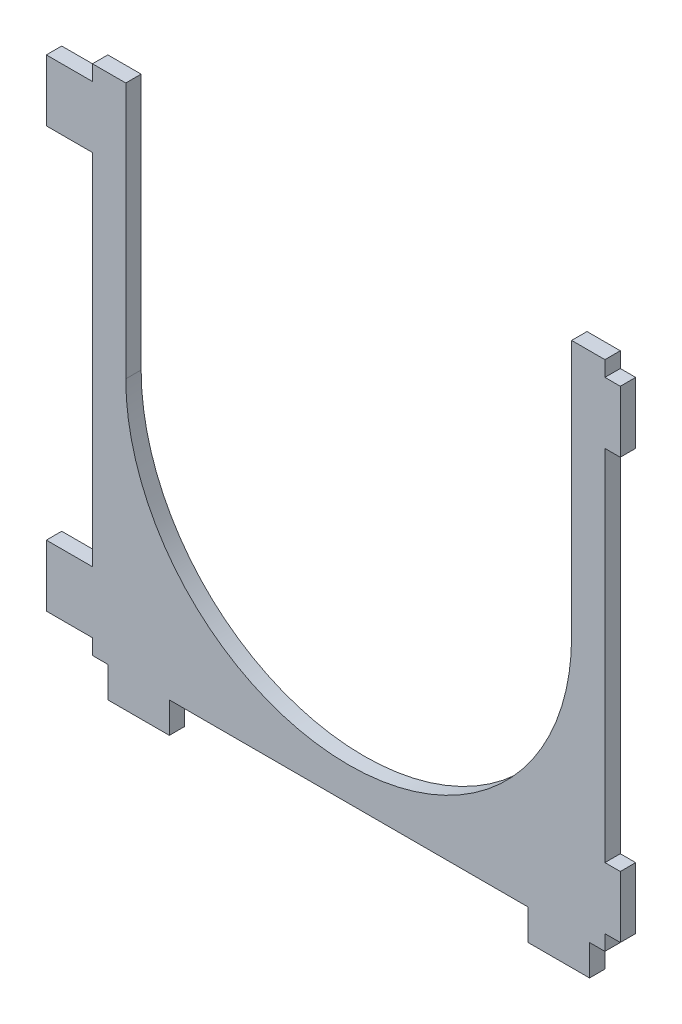
ISO-10303-21;
HEADER;
FILE_DESCRIPTION(('STEP AP214'),'2;1');
FILE_NAME('part.step','',(''),(''),'','','');
FILE_SCHEMA(('AUTOMOTIVE_DESIGN { 1 0 10303 214 1 1 1 1 }'));
ENDSEC;
DATA;
#1=APPLICATION_CONTEXT('core data for automotive mechanical design processes');
#2=APPLICATION_PROTOCOL_DEFINITION('international standard','automotive_design',2000,#1);
#3=PRODUCT_CONTEXT('',#1,'mechanical');
#4=PRODUCT('Part','Part','',(#3));
#5=PRODUCT_RELATED_PRODUCT_CATEGORY('part','',(#4));
#6=PRODUCT_DEFINITION_FORMATION('','',#4);
#7=PRODUCT_DEFINITION_CONTEXT('part definition',#1,'design');
#8=PRODUCT_DEFINITION('design','',#6,#7);
#9=PRODUCT_DEFINITION_SHAPE('','',#8);
#10=(LENGTH_UNIT() NAMED_UNIT(*) SI_UNIT(.MILLI.,.METRE.));
#11=(NAMED_UNIT(*) PLANE_ANGLE_UNIT() SI_UNIT($,.RADIAN.));
#12=(NAMED_UNIT(*) SI_UNIT($,.STERADIAN.) SOLID_ANGLE_UNIT());
#13=UNCERTAINTY_MEASURE_WITH_UNIT(LENGTH_MEASURE(1.E-05),#10,'distance_accuracy_value','');
#14=(GEOMETRIC_REPRESENTATION_CONTEXT(3) GLOBAL_UNCERTAINTY_ASSIGNED_CONTEXT((#13)) GLOBAL_UNIT_ASSIGNED_CONTEXT((#10,
#11,#12)) REPRESENTATION_CONTEXT('',''));
#15=CARTESIAN_POINT('',(0.,0.,0.));
#16=DIRECTION('',(0.,0.,1.));
#17=DIRECTION('',(1.,0.,0.));
#18=AXIS2_PLACEMENT_3D('',#15,#16,#17);
#19=CARTESIAN_POINT('',(-50.,50.,3.));
#20=DIRECTION('',(0.,-1.,0.));
#21=DIRECTION('',(0.,0.,-1.));
#22=AXIS2_PLACEMENT_3D('',#19,#20,#21);
#23=PLANE('',#22);
#24=DIRECTION('',(-1.,0.,0.));
#25=VECTOR('',#24,1.);
#26=CARTESIAN_POINT('',(-50.,50.,3.));
#27=LINE('',#26,#25);
#28=CARTESIAN_POINT('',(-43.5,50.,3.));
#29=VERTEX_POINT('',#28);
#30=CARTESIAN_POINT('',(-50.,50.,3.));
#31=VERTEX_POINT('',#30);
#32=EDGE_CURVE('E272',#29,#31,#27,.T.);
#33=ORIENTED_EDGE('',*,*,#32,.F.);
#34=DIRECTION('',(0.,0.,1.));
#35=VECTOR('',#34,1.);
#36=CARTESIAN_POINT('',(-43.5,50.,-7.));
#37=LINE('',#36,#35);
#38=CARTESIAN_POINT('',(-43.5,50.,0.));
#39=VERTEX_POINT('',#38);
#40=EDGE_CURVE('E326',#39,#29,#37,.T.);
#41=ORIENTED_EDGE('',*,*,#40,.F.);
#42=DIRECTION('',(-1.,0.,0.));
#43=VECTOR('',#42,1.);
#44=CARTESIAN_POINT('',(-50.,50.,0.));
#45=LINE('',#44,#43);
#46=CARTESIAN_POINT('',(-50.,50.,0.));
#47=VERTEX_POINT('',#46);
#48=EDGE_CURVE('E288',#39,#47,#45,.T.);
#49=ORIENTED_EDGE('',*,*,#48,.T.);
#50=DIRECTION('',(0.,0.,-1.));
#51=VECTOR('',#50,1.);
#52=CARTESIAN_POINT('',(-50.,50.,3.));
#53=LINE('',#52,#51);
#54=EDGE_CURVE('E307',#31,#47,#53,.T.);
#55=ORIENTED_EDGE('',*,*,#54,.F.);
#56=EDGE_LOOP('',(#33,#41,#49,#55));
#57=FACE_BOUND('',#56,.T.);
#58=ADVANCED_FACE('F33',(#57),#23,.F.);
#59=CARTESIAN_POINT('',(-50.,-50.,3.));
#60=DIRECTION('',(1.,0.,0.));
#61=DIRECTION('',(0.,0.,-1.));
#62=AXIS2_PLACEMENT_3D('',#59,#60,#61);
#63=PLANE('',#62);
#64=DIRECTION('',(0.,-1.,0.));
#65=VECTOR('',#64,1.);
#66=CARTESIAN_POINT('',(-50.,-50.,3.));
#67=LINE('',#66,#65);
#68=CARTESIAN_POINT('',(-50.,35.,3.));
#69=VERTEX_POINT('',#68);
#70=CARTESIAN_POINT('',(-50.,-35.,3.));
#71=VERTEX_POINT('',#70);
#72=EDGE_CURVE('E281',#69,#71,#67,.T.);
#73=ORIENTED_EDGE('',*,*,#72,.F.);
#74=DIRECTION('',(0.,0.,1.));
#75=VECTOR('',#74,1.);
#76=CARTESIAN_POINT('',(-50.,35.,0.));
#77=LINE('',#76,#75);
#78=CARTESIAN_POINT('',(-50.,35.,0.));
#79=VERTEX_POINT('',#78);
#80=EDGE_CURVE('E349',#79,#69,#77,.T.);
#81=ORIENTED_EDGE('',*,*,#80,.F.);
#82=DIRECTION('',(0.,-1.,0.));
#83=VECTOR('',#82,1.);
#84=CARTESIAN_POINT('',(-50.,-50.,0.));
#85=LINE('',#84,#83);
#86=CARTESIAN_POINT('',(-50.,-35.,0.));
#87=VERTEX_POINT('',#86);
#88=EDGE_CURVE('E297',#79,#87,#85,.T.);
#89=ORIENTED_EDGE('',*,*,#88,.T.);
#90=DIRECTION('',(0.,0.,1.));
#91=VECTOR('',#90,1.);
#92=CARTESIAN_POINT('',(-50.,-35.,0.));
#93=LINE('',#92,#91);
#94=EDGE_CURVE('E418',#87,#71,#93,.T.);
#95=ORIENTED_EDGE('',*,*,#94,.T.);
#96=EDGE_LOOP('',(#73,#81,#89,#95));
#97=FACE_BOUND('',#96,.T.);
#98=ADVANCED_FACE('F556',(#97),#63,.F.);
#99=CARTESIAN_POINT('',(50.,-50.,3.));
#100=DIRECTION('',(-1.,0.,0.));
#101=DIRECTION('',(0.,0.,1.));
#102=AXIS2_PLACEMENT_3D('',#99,#100,#101);
#103=PLANE('',#102);
#104=DIRECTION('',(0.,1.,0.));
#105=VECTOR('',#104,1.);
#106=CARTESIAN_POINT('',(50.,-50.,3.));
#107=LINE('',#106,#105);
#108=CARTESIAN_POINT('',(50.,47.,3.));
#109=VERTEX_POINT('',#108);
#110=CARTESIAN_POINT('',(50.,50.,3.));
#111=VERTEX_POINT('',#110);
#112=EDGE_CURVE('E274',#109,#111,#107,.T.);
#113=ORIENTED_EDGE('',*,*,#112,.F.);
#114=DIRECTION('',(0.,0.,1.));
#115=VECTOR('',#114,1.);
#116=CARTESIAN_POINT('',(50.,47.,0.));
#117=LINE('',#116,#115);
#118=CARTESIAN_POINT('',(50.,47.,0.));
#119=VERTEX_POINT('',#118);
#120=EDGE_CURVE('E319',#119,#109,#117,.T.);
#121=ORIENTED_EDGE('',*,*,#120,.F.);
#122=DIRECTION('',(0.,1.,0.));
#123=VECTOR('',#122,1.);
#124=CARTESIAN_POINT('',(50.,-50.,0.));
#125=LINE('',#124,#123);
#126=CARTESIAN_POINT('',(50.,50.,0.));
#127=VERTEX_POINT('',#126);
#128=EDGE_CURVE('E257',#119,#127,#125,.T.);
#129=ORIENTED_EDGE('',*,*,#128,.T.);
#130=DIRECTION('',(0.,0.,-1.));
#131=VECTOR('',#130,1.);
#132=CARTESIAN_POINT('',(50.,50.,3.));
#133=LINE('',#132,#131);
#134=EDGE_CURVE('E246',#111,#127,#133,.T.);
#135=ORIENTED_EDGE('',*,*,#134,.F.);
#136=EDGE_LOOP('',(#113,#121,#129,#135));
#137=FACE_BOUND('',#136,.T.);
#138=ADVANCED_FACE('F316',(#137),#103,.F.);
#139=CARTESIAN_POINT('',(50.,-35.,0.));
#140=VERTEX_POINT('',#139);
#141=CARTESIAN_POINT('',(50.,35.,0.));
#142=VERTEX_POINT('',#141);
#143=EDGE_CURVE('E260',#140,#142,#125,.T.);
#144=ORIENTED_EDGE('',*,*,#143,.T.);
#145=DIRECTION('',(0.,0.,1.));
#146=VECTOR('',#145,1.);
#147=CARTESIAN_POINT('',(50.,35.,0.));
#148=LINE('',#147,#146);
#149=CARTESIAN_POINT('',(50.,35.,3.));
#150=VERTEX_POINT('',#149);
#151=EDGE_CURVE('E368',#142,#150,#148,.T.);
#152=ORIENTED_EDGE('',*,*,#151,.T.);
#153=CARTESIAN_POINT('',(50.,-35.,3.));
#154=VERTEX_POINT('',#153);
#155=EDGE_CURVE('E273',#154,#150,#107,.T.);
#156=ORIENTED_EDGE('',*,*,#155,.F.);
#157=DIRECTION('',(0.,0.,1.));
#158=VECTOR('',#157,1.);
#159=CARTESIAN_POINT('',(50.,-35.,0.));
#160=LINE('',#159,#158);
#161=EDGE_CURVE('E400',#140,#154,#160,.T.);
#162=ORIENTED_EDGE('',*,*,#161,.F.);
#163=EDGE_LOOP('',(#144,#152,#156,#162));
#164=FACE_BOUND('',#163,.T.);
#165=ADVANCED_FACE('F533',(#164),#103,.F.);
#166=DIRECTION('',(0.,0.,1.));
#167=VECTOR('',#166,1.);
#168=CARTESIAN_POINT('',(-50.,-47.,0.));
#169=LINE('',#168,#167);
#170=CARTESIAN_POINT('',(-50.,-47.,0.));
#171=VERTEX_POINT('',#170);
#172=CARTESIAN_POINT('',(-50.,-47.,3.));
#173=VERTEX_POINT('',#172);
#174=EDGE_CURVE('E426',#171,#173,#169,.T.);
#175=ORIENTED_EDGE('',*,*,#174,.F.);
#176=CARTESIAN_POINT('',(-50.,-50.,0.));
#177=VERTEX_POINT('',#176);
#178=EDGE_CURVE('E292',#171,#177,#85,.T.);
#179=ORIENTED_EDGE('',*,*,#178,.T.);
#180=DIRECTION('',(0.,0.,-1.));
#181=VECTOR('',#180,1.);
#182=CARTESIAN_POINT('',(-50.,-50.,3.));
#183=LINE('',#182,#181);
#184=CARTESIAN_POINT('',(-50.,-50.,3.));
#185=VERTEX_POINT('',#184);
#186=EDGE_CURVE('E304',#185,#177,#183,.T.);
#187=ORIENTED_EDGE('',*,*,#186,.F.);
#188=EDGE_CURVE('E276',#173,#185,#67,.T.);
#189=ORIENTED_EDGE('',*,*,#188,.F.);
#190=EDGE_LOOP('',(#175,#179,#187,#189));
#191=FACE_BOUND('',#190,.T.);
#192=ADVANCED_FACE('F565',(#191),#63,.F.);
#193=CARTESIAN_POINT('',(-50.,-50.,3.));
#194=DIRECTION('',(0.,1.,0.));
#195=DIRECTION('',(0.,0.,1.));
#196=AXIS2_PLACEMENT_3D('',#193,#194,#195);
#197=PLANE('',#196);
#198=DIRECTION('',(1.,0.,0.));
#199=VECTOR('',#198,1.);
#200=CARTESIAN_POINT('',(-50.,-50.,3.));
#201=LINE('',#200,#199);
#202=CARTESIAN_POINT('',(47.,-50.,3.));
#203=VERTEX_POINT('',#202);
#204=CARTESIAN_POINT('',(50.,-50.,3.));
#205=VERTEX_POINT('',#204);
#206=EDGE_CURVE('E280',#203,#205,#201,.T.);
#207=ORIENTED_EDGE('',*,*,#206,.F.);
#208=DIRECTION('',(0.,0.,1.));
#209=VECTOR('',#208,1.);
#210=CARTESIAN_POINT('',(47.,-50.,0.));
#211=LINE('',#210,#209);
#212=CARTESIAN_POINT('',(47.,-50.,0.));
#213=VERTEX_POINT('',#212);
#214=EDGE_CURVE('E445',#213,#203,#211,.T.);
#215=ORIENTED_EDGE('',*,*,#214,.F.);
#216=DIRECTION('',(1.,0.,0.));
#217=VECTOR('',#216,1.);
#218=CARTESIAN_POINT('',(-50.,-50.,0.));
#219=LINE('',#218,#217);
#220=CARTESIAN_POINT('',(50.,-50.,0.));
#221=VERTEX_POINT('',#220);
#222=EDGE_CURVE('E296',#213,#221,#219,.T.);
#223=ORIENTED_EDGE('',*,*,#222,.T.);
#224=DIRECTION('',(0.,0.,-1.));
#225=VECTOR('',#224,1.);
#226=CARTESIAN_POINT('',(50.,-50.,3.));
#227=LINE('',#226,#225);
#228=EDGE_CURVE('E284',#205,#221,#227,.T.);
#229=ORIENTED_EDGE('',*,*,#228,.F.);
#230=EDGE_LOOP('',(#207,#215,#223,#229));
#231=FACE_BOUND('',#230,.T.);
#232=ADVANCED_FACE('F514',(#231),#197,.F.);
#233=CARTESIAN_POINT('',(-35.,-50.,0.));
#234=VERTEX_POINT('',#233);
#235=CARTESIAN_POINT('',(35.,-50.,0.));
#236=VERTEX_POINT('',#235);
#237=EDGE_CURVE('E301',#234,#236,#219,.T.);
#238=ORIENTED_EDGE('',*,*,#237,.T.);
#239=DIRECTION('',(0.,0.,1.));
#240=VECTOR('',#239,1.);
#241=CARTESIAN_POINT('',(35.,-50.,0.));
#242=LINE('',#241,#240);
#243=CARTESIAN_POINT('',(35.,-50.,3.));
#244=VERTEX_POINT('',#243);
#245=EDGE_CURVE('E458',#236,#244,#242,.T.);
#246=ORIENTED_EDGE('',*,*,#245,.T.);
#247=CARTESIAN_POINT('',(-35.,-50.,3.));
#248=VERTEX_POINT('',#247);
#249=EDGE_CURVE('E285',#248,#244,#201,.T.);
#250=ORIENTED_EDGE('',*,*,#249,.F.);
#251=DIRECTION('',(0.,0.,1.));
#252=VECTOR('',#251,1.);
#253=CARTESIAN_POINT('',(-35.,-50.,0.));
#254=LINE('',#253,#252);
#255=EDGE_CURVE('E480',#234,#248,#254,.T.);
#256=ORIENTED_EDGE('',*,*,#255,.F.);
#257=EDGE_LOOP('',(#238,#246,#250,#256));
#258=FACE_BOUND('',#257,.T.);
#259=ADVANCED_FACE('F505',(#258),#197,.F.);
#260=CARTESIAN_POINT('',(0.,0.,3.));
#261=DIRECTION('',(0.,0.,-1.));
#262=DIRECTION('',(-1.,0.,0.));
#263=AXIS2_PLACEMENT_3D('',#260,#261,#262);
#264=PLANE('',#263);
#265=CARTESIAN_POINT('',(0.,0.,3.));
#266=DIRECTION('',(0.,0.,1.));
#267=DIRECTION('',(1.,0.,0.));
#268=AXIS2_PLACEMENT_3D('',#265,#266,#267);
#269=CIRCLE('',#268,43.5);
#270=CARTESIAN_POINT('',(-43.5,0.,3.));
#271=VERTEX_POINT('',#270);
#272=CARTESIAN_POINT('',(43.5,0.,3.));
#273=VERTEX_POINT('',#272);
#274=EDGE_CURVE('E251',#271,#273,#269,.T.);
#275=ORIENTED_EDGE('',*,*,#274,.F.);
#276=DIRECTION('',(0.,-1.,0.));
#277=VECTOR('',#276,1.);
#278=CARTESIAN_POINT('',(-43.5,0.,3.));
#279=LINE('',#278,#277);
#280=EDGE_CURVE('E55',#29,#271,#279,.T.);
#281=ORIENTED_EDGE('',*,*,#280,.F.);
#282=ORIENTED_EDGE('',*,*,#32,.T.);
#283=CARTESIAN_POINT('',(-50.,47.,3.));
#284=VERTEX_POINT('',#283);
#285=EDGE_CURVE('E277',#31,#284,#67,.T.);
#286=ORIENTED_EDGE('',*,*,#285,.T.);
#287=DIRECTION('',(-1.,0.,0.));
#288=VECTOR('',#287,1.);
#289=CARTESIAN_POINT('',(-50.,47.,3.));
#290=LINE('',#289,#288);
#291=CARTESIAN_POINT('',(-59.,47.,3.));
#292=VERTEX_POINT('',#291);
#293=EDGE_CURVE('E328',#284,#292,#290,.T.);
#294=ORIENTED_EDGE('',*,*,#293,.T.);
#295=DIRECTION('',(0.,-1.,0.));
#296=VECTOR('',#295,1.);
#297=CARTESIAN_POINT('',(-59.,47.,3.));
#298=LINE('',#297,#296);
#299=CARTESIAN_POINT('',(-59.,35.,3.));
#300=VERTEX_POINT('',#299);
#301=EDGE_CURVE('E345',#292,#300,#298,.T.);
#302=ORIENTED_EDGE('',*,*,#301,.T.);
#303=DIRECTION('',(1.,0.,0.));
#304=VECTOR('',#303,1.);
#305=CARTESIAN_POINT('',(-50.,35.,3.));
#306=LINE('',#305,#304);
#307=EDGE_CURVE('E337',#300,#69,#306,.T.);
#308=ORIENTED_EDGE('',*,*,#307,.T.);
#309=ORIENTED_EDGE('',*,*,#72,.T.);
#310=DIRECTION('',(-1.,0.,0.));
#311=VECTOR('',#310,1.);
#312=CARTESIAN_POINT('',(-50.,-35.,3.));
#313=LINE('',#312,#311);
#314=CARTESIAN_POINT('',(-59.,-35.,3.));
#315=VERTEX_POINT('',#314);
#316=EDGE_CURVE('E402',#71,#315,#313,.T.);
#317=ORIENTED_EDGE('',*,*,#316,.T.);
#318=DIRECTION('',(0.,-1.,0.));
#319=VECTOR('',#318,1.);
#320=CARTESIAN_POINT('',(-59.,-47.,3.));
#321=LINE('',#320,#319);
#322=CARTESIAN_POINT('',(-59.,-47.,3.));
#323=VERTEX_POINT('',#322);
#324=EDGE_CURVE('E421',#315,#323,#321,.T.);
#325=ORIENTED_EDGE('',*,*,#324,.T.);
#326=DIRECTION('',(1.,0.,0.));
#327=VECTOR('',#326,1.);
#328=CARTESIAN_POINT('',(-50.,-47.,3.));
#329=LINE('',#328,#327);
#330=EDGE_CURVE('E413',#323,#173,#329,.T.);
#331=ORIENTED_EDGE('',*,*,#330,.T.);
#332=ORIENTED_EDGE('',*,*,#188,.T.);
#333=CARTESIAN_POINT('',(-47.,-50.,3.));
#334=VERTEX_POINT('',#333);
#335=EDGE_CURVE('E282',#185,#334,#201,.T.);
#336=ORIENTED_EDGE('',*,*,#335,.T.);
#337=DIRECTION('',(0.,-1.,0.));
#338=VECTOR('',#337,1.);
#339=CARTESIAN_POINT('',(-47.,-50.,3.));
#340=LINE('',#339,#338);
#341=CARTESIAN_POINT('',(-47.,-56.,3.));
#342=VERTEX_POINT('',#341);
#343=EDGE_CURVE('E455',#334,#342,#340,.T.);
#344=ORIENTED_EDGE('',*,*,#343,.T.);
#345=DIRECTION('',(1.,0.,0.));
#346=VECTOR('',#345,1.);
#347=CARTESIAN_POINT('',(-47.,-56.,3.));
#348=LINE('',#347,#346);
#349=CARTESIAN_POINT('',(-35.,-56.,3.));
#350=VERTEX_POINT('',#349);
#351=EDGE_CURVE('E473',#342,#350,#348,.T.);
#352=ORIENTED_EDGE('',*,*,#351,.T.);
#353=DIRECTION('',(0.,1.,0.));
#354=VECTOR('',#353,1.);
#355=CARTESIAN_POINT('',(-35.,-50.,3.));
#356=LINE('',#355,#354);
#357=EDGE_CURVE('E466',#350,#248,#356,.T.);
#358=ORIENTED_EDGE('',*,*,#357,.T.);
#359=ORIENTED_EDGE('',*,*,#249,.T.);
#360=DIRECTION('',(0.,-1.,0.));
#361=VECTOR('',#360,1.);
#362=CARTESIAN_POINT('',(35.,-50.,3.));
#363=LINE('',#362,#361);
#364=CARTESIAN_POINT('',(35.,-56.,3.));
#365=VERTEX_POINT('',#364);
#366=EDGE_CURVE('E448',#244,#365,#363,.T.);
#367=ORIENTED_EDGE('',*,*,#366,.T.);
#368=DIRECTION('',(1.,0.,0.));
#369=VECTOR('',#368,1.);
#370=CARTESIAN_POINT('',(47.,-56.,3.));
#371=LINE('',#370,#369);
#372=CARTESIAN_POINT('',(47.,-56.,3.));
#373=VERTEX_POINT('',#372);
#374=EDGE_CURVE('E439',#365,#373,#371,.T.);
#375=ORIENTED_EDGE('',*,*,#374,.T.);
#376=DIRECTION('',(0.,1.,0.));
#377=VECTOR('',#376,1.);
#378=CARTESIAN_POINT('',(47.,-50.,3.));
#379=LINE('',#378,#377);
#380=EDGE_CURVE('E428',#373,#203,#379,.T.);
#381=ORIENTED_EDGE('',*,*,#380,.T.);
#382=ORIENTED_EDGE('',*,*,#206,.T.);
#383=CARTESIAN_POINT('',(50.,-47.,3.));
#384=VERTEX_POINT('',#383);
#385=EDGE_CURVE('E269',#205,#384,#107,.T.);
#386=ORIENTED_EDGE('',*,*,#385,.T.);
#387=DIRECTION('',(1.,0.,0.));
#388=VECTOR('',#387,1.);
#389=CARTESIAN_POINT('',(50.,-47.,3.));
#390=LINE('',#389,#388);
#391=CARTESIAN_POINT('',(53.,-47.,3.));
#392=VERTEX_POINT('',#391);
#393=EDGE_CURVE('E377',#384,#392,#390,.T.);
#394=ORIENTED_EDGE('',*,*,#393,.T.);
#395=DIRECTION('',(0.,1.,0.));
#396=VECTOR('',#395,1.);
#397=CARTESIAN_POINT('',(53.,-47.,3.));
#398=LINE('',#397,#396);
#399=CARTESIAN_POINT('',(53.,-35.,3.));
#400=VERTEX_POINT('',#399);
#401=EDGE_CURVE('E395',#392,#400,#398,.T.);
#402=ORIENTED_EDGE('',*,*,#401,.T.);
#403=DIRECTION('',(-1.,0.,0.));
#404=VECTOR('',#403,1.);
#405=CARTESIAN_POINT('',(50.,-35.,3.));
#406=LINE('',#405,#404);
#407=EDGE_CURVE('E387',#400,#154,#406,.T.);
#408=ORIENTED_EDGE('',*,*,#407,.T.);
#409=ORIENTED_EDGE('',*,*,#155,.T.);
#410=DIRECTION('',(1.,0.,0.));
#411=VECTOR('',#410,1.);
#412=CARTESIAN_POINT('',(50.,35.,3.));
#413=LINE('',#412,#411);
#414=CARTESIAN_POINT('',(53.,35.,3.));
#415=VERTEX_POINT('',#414);
#416=EDGE_CURVE('E352',#150,#415,#413,.T.);
#417=ORIENTED_EDGE('',*,*,#416,.T.);
#418=DIRECTION('',(0.,1.,0.));
#419=VECTOR('',#418,1.);
#420=CARTESIAN_POINT('',(53.,47.,3.));
#421=LINE('',#420,#419);
#422=CARTESIAN_POINT('',(53.,47.,3.));
#423=VERTEX_POINT('',#422);
#424=EDGE_CURVE('E371',#415,#423,#421,.T.);
#425=ORIENTED_EDGE('',*,*,#424,.T.);
#426=DIRECTION('',(-1.,0.,0.));
#427=VECTOR('',#426,1.);
#428=CARTESIAN_POINT('',(50.,47.,3.));
#429=LINE('',#428,#427);
#430=EDGE_CURVE('E363',#423,#109,#429,.T.);
#431=ORIENTED_EDGE('',*,*,#430,.T.);
#432=ORIENTED_EDGE('',*,*,#112,.T.);
#433=CARTESIAN_POINT('',(43.5,50.,3.));
#434=VERTEX_POINT('',#433);
#435=EDGE_CURVE('E253',#111,#434,#27,.T.);
#436=ORIENTED_EDGE('',*,*,#435,.T.);
#437=DIRECTION('',(0.,1.,0.));
#438=VECTOR('',#437,1.);
#439=CARTESIAN_POINT('',(43.5,0.,3.));
#440=LINE('',#439,#438);
#441=EDGE_CURVE('E240',#273,#434,#440,.T.);
#442=ORIENTED_EDGE('',*,*,#441,.F.);
#443=EDGE_LOOP('',(#275,#281,#282,#286,#294,#302,#308,#309,#317,#325,#331,#332,#336,#344,#352,
#358,#359,#367,#375,#381,#382,#386,#394,#402,#408,#409,#417,#425,#431,#432,#436,#442));
#444=FACE_BOUND('',#443,.T.);
#445=ADVANCED_FACE('F250',(#444),#264,.F.);
#446=CARTESIAN_POINT('',(0.,0.,0.));
#447=DIRECTION('',(0.,0.,-1.));
#448=DIRECTION('',(-1.,0.,0.));
#449=AXIS2_PLACEMENT_3D('',#446,#447,#448);
#450=PLANE('',#449);
#451=DIRECTION('',(0.,1.,0.));
#452=VECTOR('',#451,1.);
#453=CARTESIAN_POINT('',(-43.5,0.,0.));
#454=LINE('',#453,#452);
#455=CARTESIAN_POINT('',(-43.5,0.,0.));
#456=VERTEX_POINT('',#455);
#457=EDGE_CURVE('E325',#456,#39,#454,.T.);
#458=ORIENTED_EDGE('',*,*,#457,.F.);
#459=CARTESIAN_POINT('',(0.,0.,0.));
#460=DIRECTION('',(0.,0.,1.));
#461=DIRECTION('',(1.,0.,0.));
#462=AXIS2_PLACEMENT_3D('',#459,#460,#461);
#463=CIRCLE('',#462,43.5);
#464=CARTESIAN_POINT('',(43.5,0.,0.));
#465=VERTEX_POINT('',#464);
#466=EDGE_CURVE('E258',#456,#465,#463,.T.);
#467=ORIENTED_EDGE('',*,*,#466,.T.);
#468=DIRECTION('',(0.,-1.,0.));
#469=VECTOR('',#468,1.);
#470=CARTESIAN_POINT('',(43.5,0.,0.));
#471=LINE('',#470,#469);
#472=CARTESIAN_POINT('',(43.5,50.,0.));
#473=VERTEX_POINT('',#472);
#474=EDGE_CURVE('E48',#473,#465,#471,.T.);
#475=ORIENTED_EDGE('',*,*,#474,.F.);
#476=EDGE_CURVE('E289',#127,#473,#45,.T.);
#477=ORIENTED_EDGE('',*,*,#476,.F.);
#478=ORIENTED_EDGE('',*,*,#128,.F.);
#479=DIRECTION('',(-1.,0.,0.));
#480=VECTOR('',#479,1.);
#481=CARTESIAN_POINT('',(50.,47.,0.));
#482=LINE('',#481,#480);
#483=CARTESIAN_POINT('',(53.,47.,0.));
#484=VERTEX_POINT('',#483);
#485=EDGE_CURVE('E366',#484,#119,#482,.T.);
#486=ORIENTED_EDGE('',*,*,#485,.F.);
#487=DIRECTION('',(0.,1.,0.));
#488=VECTOR('',#487,1.);
#489=CARTESIAN_POINT('',(53.,47.,0.));
#490=LINE('',#489,#488);
#491=CARTESIAN_POINT('',(53.,35.,0.));
#492=VERTEX_POINT('',#491);
#493=EDGE_CURVE('E362',#492,#484,#490,.T.);
#494=ORIENTED_EDGE('',*,*,#493,.F.);
#495=DIRECTION('',(1.,0.,0.));
#496=VECTOR('',#495,1.);
#497=CARTESIAN_POINT('',(50.,35.,0.));
#498=LINE('',#497,#496);
#499=EDGE_CURVE('E359',#142,#492,#498,.T.);
#500=ORIENTED_EDGE('',*,*,#499,.F.);
#501=ORIENTED_EDGE('',*,*,#143,.F.);
#502=DIRECTION('',(-1.,0.,0.));
#503=VECTOR('',#502,1.);
#504=CARTESIAN_POINT('',(50.,-35.,0.));
#505=LINE('',#504,#503);
#506=CARTESIAN_POINT('',(53.,-35.,0.));
#507=VERTEX_POINT('',#506);
#508=EDGE_CURVE('E390',#507,#140,#505,.T.);
#509=ORIENTED_EDGE('',*,*,#508,.F.);
#510=DIRECTION('',(0.,1.,0.));
#511=VECTOR('',#510,1.);
#512=CARTESIAN_POINT('',(53.,-47.,0.));
#513=LINE('',#512,#511);
#514=CARTESIAN_POINT('',(53.,-47.,0.));
#515=VERTEX_POINT('',#514);
#516=EDGE_CURVE('E386',#515,#507,#513,.T.);
#517=ORIENTED_EDGE('',*,*,#516,.F.);
#518=DIRECTION('',(1.,0.,0.));
#519=VECTOR('',#518,1.);
#520=CARTESIAN_POINT('',(50.,-47.,0.));
#521=LINE('',#520,#519);
#522=CARTESIAN_POINT('',(50.,-47.,0.));
#523=VERTEX_POINT('',#522);
#524=EDGE_CURVE('E383',#523,#515,#521,.T.);
#525=ORIENTED_EDGE('',*,*,#524,.F.);
#526=EDGE_CURVE('E262',#221,#523,#125,.T.);
#527=ORIENTED_EDGE('',*,*,#526,.F.);
#528=ORIENTED_EDGE('',*,*,#222,.F.);
#529=DIRECTION('',(0.,1.,0.));
#530=VECTOR('',#529,1.);
#531=CARTESIAN_POINT('',(47.,-50.,0.));
#532=LINE('',#531,#530);
#533=CARTESIAN_POINT('',(47.,-56.,0.));
#534=VERTEX_POINT('',#533);
#535=EDGE_CURVE('E435',#534,#213,#532,.T.);
#536=ORIENTED_EDGE('',*,*,#535,.F.);
#537=DIRECTION('',(1.,0.,0.));
#538=VECTOR('',#537,1.);
#539=CARTESIAN_POINT('',(47.,-56.,0.));
#540=LINE('',#539,#538);
#541=CARTESIAN_POINT('',(35.,-56.,0.));
#542=VERTEX_POINT('',#541);
#543=EDGE_CURVE('E442',#542,#534,#540,.T.);
#544=ORIENTED_EDGE('',*,*,#543,.F.);
#545=DIRECTION('',(0.,-1.,0.));
#546=VECTOR('',#545,1.);
#547=CARTESIAN_POINT('',(35.,-50.,0.));
#548=LINE('',#547,#546);
#549=EDGE_CURVE('E438',#236,#542,#548,.T.);
#550=ORIENTED_EDGE('',*,*,#549,.F.);
#551=ORIENTED_EDGE('',*,*,#237,.F.);
#552=DIRECTION('',(0.,1.,0.));
#553=VECTOR('',#552,1.);
#554=CARTESIAN_POINT('',(-35.,-50.,0.));
#555=LINE('',#554,#553);
#556=CARTESIAN_POINT('',(-35.,-56.,0.));
#557=VERTEX_POINT('',#556);
#558=EDGE_CURVE('E469',#557,#234,#555,.T.);
#559=ORIENTED_EDGE('',*,*,#558,.F.);
#560=DIRECTION('',(1.,0.,0.));
#561=VECTOR('',#560,1.);
#562=CARTESIAN_POINT('',(-47.,-56.,0.));
#563=LINE('',#562,#561);
#564=CARTESIAN_POINT('',(-47.,-56.,0.));
#565=VERTEX_POINT('',#564);
#566=EDGE_CURVE('E465',#565,#557,#563,.T.);
#567=ORIENTED_EDGE('',*,*,#566,.F.);
#568=DIRECTION('',(0.,-1.,0.));
#569=VECTOR('',#568,1.);
#570=CARTESIAN_POINT('',(-47.,-50.,0.));
#571=LINE('',#570,#569);
#572=CARTESIAN_POINT('',(-47.,-50.,0.));
#573=VERTEX_POINT('',#572);
#574=EDGE_CURVE('E462',#573,#565,#571,.T.);
#575=ORIENTED_EDGE('',*,*,#574,.F.);
#576=EDGE_CURVE('E298',#177,#573,#219,.T.);
#577=ORIENTED_EDGE('',*,*,#576,.F.);
#578=ORIENTED_EDGE('',*,*,#178,.F.);
#579=DIRECTION('',(1.,0.,0.));
#580=VECTOR('',#579,1.);
#581=CARTESIAN_POINT('',(-50.,-47.,0.));
#582=LINE('',#581,#580);
#583=CARTESIAN_POINT('',(-59.,-47.,0.));
#584=VERTEX_POINT('',#583);
#585=EDGE_CURVE('E416',#584,#171,#582,.T.);
#586=ORIENTED_EDGE('',*,*,#585,.F.);
#587=DIRECTION('',(0.,-1.,0.));
#588=VECTOR('',#587,1.);
#589=CARTESIAN_POINT('',(-59.,-47.,0.));
#590=LINE('',#589,#588);
#591=CARTESIAN_POINT('',(-59.,-35.,0.));
#592=VERTEX_POINT('',#591);
#593=EDGE_CURVE('E412',#592,#584,#590,.T.);
#594=ORIENTED_EDGE('',*,*,#593,.F.);
#595=DIRECTION('',(-1.,0.,0.));
#596=VECTOR('',#595,1.);
#597=CARTESIAN_POINT('',(-50.,-35.,0.));
#598=LINE('',#597,#596);
#599=EDGE_CURVE('E409',#87,#592,#598,.T.);
#600=ORIENTED_EDGE('',*,*,#599,.F.);
#601=ORIENTED_EDGE('',*,*,#88,.F.);
#602=DIRECTION('',(1.,0.,0.));
#603=VECTOR('',#602,1.);
#604=CARTESIAN_POINT('',(-50.,35.,0.));
#605=LINE('',#604,#603);
#606=CARTESIAN_POINT('',(-59.,35.,0.));
#607=VERTEX_POINT('',#606);
#608=EDGE_CURVE('E340',#607,#79,#605,.T.);
#609=ORIENTED_EDGE('',*,*,#608,.F.);
#610=DIRECTION('',(0.,-1.,0.));
#611=VECTOR('',#610,1.);
#612=CARTESIAN_POINT('',(-59.,47.,0.));
#613=LINE('',#612,#611);
#614=CARTESIAN_POINT('',(-59.,47.,0.));
#615=VERTEX_POINT('',#614);
#616=EDGE_CURVE('E336',#615,#607,#613,.T.);
#617=ORIENTED_EDGE('',*,*,#616,.F.);
#618=DIRECTION('',(-1.,0.,0.));
#619=VECTOR('',#618,1.);
#620=CARTESIAN_POINT('',(-50.,47.,0.));
#621=LINE('',#620,#619);
#622=CARTESIAN_POINT('',(-50.,47.,0.));
#623=VERTEX_POINT('',#622);
#624=EDGE_CURVE('E333',#623,#615,#621,.T.);
#625=ORIENTED_EDGE('',*,*,#624,.F.);
#626=EDGE_CURVE('E293',#47,#623,#85,.T.);
#627=ORIENTED_EDGE('',*,*,#626,.F.);
#628=ORIENTED_EDGE('',*,*,#48,.F.);
#629=EDGE_LOOP('',(#458,#467,#475,#477,#478,#486,#494,#500,#501,#509,#517,#525,#527,#528,#536,
#544,#550,#551,#559,#567,#575,#577,#578,#586,#594,#600,#601,#609,#617,#625,#627,#628));
#630=FACE_BOUND('',#629,.T.);
#631=ADVANCED_FACE('F324',(#630),#450,.T.);
#632=ORIENTED_EDGE('',*,*,#526,.T.);
#633=DIRECTION('',(0.,0.,1.));
#634=VECTOR('',#633,1.);
#635=CARTESIAN_POINT('',(50.,-47.,0.));
#636=LINE('',#635,#634);
#637=EDGE_CURVE('E392',#523,#384,#636,.T.);
#638=ORIENTED_EDGE('',*,*,#637,.T.);
#639=ORIENTED_EDGE('',*,*,#385,.F.);
#640=ORIENTED_EDGE('',*,*,#228,.T.);
#641=EDGE_LOOP('',(#632,#638,#639,#640));
#642=FACE_BOUND('',#641,.T.);
#643=ADVANCED_FACE('F35',(#642),#103,.F.);
#644=ORIENTED_EDGE('',*,*,#476,.T.);
#645=DIRECTION('',(0.,0.,1.));
#646=VECTOR('',#645,1.);
#647=CARTESIAN_POINT('',(43.5,50.,-7.));
#648=LINE('',#647,#646);
#649=EDGE_CURVE('E254',#473,#434,#648,.T.);
#650=ORIENTED_EDGE('',*,*,#649,.T.);
#651=ORIENTED_EDGE('',*,*,#435,.F.);
#652=ORIENTED_EDGE('',*,*,#134,.T.);
#653=EDGE_LOOP('',(#644,#650,#651,#652));
#654=FACE_BOUND('',#653,.T.);
#655=ADVANCED_FACE('F313',(#654),#23,.F.);
#656=ORIENTED_EDGE('',*,*,#626,.T.);
#657=DIRECTION('',(0.,0.,1.));
#658=VECTOR('',#657,1.);
#659=CARTESIAN_POINT('',(-50.,47.,0.));
#660=LINE('',#659,#658);
#661=EDGE_CURVE('E342',#623,#284,#660,.T.);
#662=ORIENTED_EDGE('',*,*,#661,.T.);
#663=ORIENTED_EDGE('',*,*,#285,.F.);
#664=ORIENTED_EDGE('',*,*,#54,.T.);
#665=EDGE_LOOP('',(#656,#662,#663,#664));
#666=FACE_BOUND('',#665,.T.);
#667=ADVANCED_FACE('F566',(#666),#63,.F.);
#668=ORIENTED_EDGE('',*,*,#576,.T.);
#669=DIRECTION('',(0.,0.,1.));
#670=VECTOR('',#669,1.);
#671=CARTESIAN_POINT('',(-47.,-50.,0.));
#672=LINE('',#671,#670);
#673=EDGE_CURVE('E263',#573,#334,#672,.T.);
#674=ORIENTED_EDGE('',*,*,#673,.T.);
#675=ORIENTED_EDGE('',*,*,#335,.F.);
#676=ORIENTED_EDGE('',*,*,#186,.T.);
#677=EDGE_LOOP('',(#668,#674,#675,#676));
#678=FACE_BOUND('',#677,.T.);
#679=ADVANCED_FACE('F494',(#678),#197,.F.);
#680=CARTESIAN_POINT('',(0.,0.,3.));
#681=DIRECTION('',(0.,0.,-1.));
#682=DIRECTION('',(-1.,0.,0.));
#683=AXIS2_PLACEMENT_3D('',#680,#681,#682);
#684=CYLINDRICAL_SURFACE('',#683,43.5);
#685=DIRECTION('',(0.,0.,-1.));
#686=VECTOR('',#685,1.);
#687=CARTESIAN_POINT('',(-43.5,0.,3.));
#688=LINE('',#687,#686);
#689=EDGE_CURVE('E11',#271,#456,#688,.T.);
#690=ORIENTED_EDGE('',*,*,#689,.F.);
#691=ORIENTED_EDGE('',*,*,#274,.T.);
#692=DIRECTION('',(0.,0.,-1.));
#693=VECTOR('',#692,1.);
#694=CARTESIAN_POINT('',(43.5,0.,3.));
#695=LINE('',#694,#693);
#696=EDGE_CURVE('E41',#465,#273,#695,.F.);
#697=ORIENTED_EDGE('',*,*,#696,.F.);
#698=ORIENTED_EDGE('',*,*,#466,.F.);
#699=EDGE_LOOP('',(#690,#691,#697,#698));
#700=FACE_BOUND('',#699,.T.);
#701=ADVANCED_FACE('F256',(#700),#684,.F.);
#702=CARTESIAN_POINT('',(-47.,-50.,0.));
#703=DIRECTION('',(-1.,0.,0.));
#704=DIRECTION('',(0.,0.,1.));
#705=AXIS2_PLACEMENT_3D('',#702,#703,#704);
#706=PLANE('',#705);
#707=ORIENTED_EDGE('',*,*,#343,.F.);
#708=ORIENTED_EDGE('',*,*,#673,.F.);
#709=ORIENTED_EDGE('',*,*,#574,.T.);
#710=DIRECTION('',(0.,0.,1.));
#711=VECTOR('',#710,1.);
#712=CARTESIAN_POINT('',(-47.,-56.,0.));
#713=LINE('',#712,#711);
#714=EDGE_CURVE('E266',#565,#342,#713,.T.);
#715=ORIENTED_EDGE('',*,*,#714,.T.);
#716=EDGE_LOOP('',(#707,#708,#709,#715));
#717=FACE_BOUND('',#716,.T.);
#718=ADVANCED_FACE('F486',(#717),#706,.T.);
#719=CARTESIAN_POINT('',(-35.,-50.,0.));
#720=DIRECTION('',(1.,0.,0.));
#721=DIRECTION('',(0.,0.,-1.));
#722=AXIS2_PLACEMENT_3D('',#719,#720,#721);
#723=PLANE('',#722);
#724=ORIENTED_EDGE('',*,*,#357,.F.);
#725=DIRECTION('',(0.,0.,1.));
#726=VECTOR('',#725,1.);
#727=CARTESIAN_POINT('',(-35.,-56.,0.));
#728=LINE('',#727,#726);
#729=EDGE_CURVE('E481',#557,#350,#728,.T.);
#730=ORIENTED_EDGE('',*,*,#729,.F.);
#731=ORIENTED_EDGE('',*,*,#558,.T.);
#732=ORIENTED_EDGE('',*,*,#255,.T.);
#733=EDGE_LOOP('',(#724,#730,#731,#732));
#734=FACE_BOUND('',#733,.T.);
#735=ADVANCED_FACE('F502',(#734),#723,.T.);
#736=CARTESIAN_POINT('',(-47.,-56.,0.));
#737=DIRECTION('',(0.,-1.,0.));
#738=DIRECTION('',(0.,0.,-1.));
#739=AXIS2_PLACEMENT_3D('',#736,#737,#738);
#740=PLANE('',#739);
#741=ORIENTED_EDGE('',*,*,#351,.F.);
#742=ORIENTED_EDGE('',*,*,#714,.F.);
#743=ORIENTED_EDGE('',*,*,#566,.T.);
#744=ORIENTED_EDGE('',*,*,#729,.T.);
#745=EDGE_LOOP('',(#741,#742,#743,#744));
#746=FACE_BOUND('',#745,.T.);
#747=ADVANCED_FACE('F489',(#746),#740,.T.);
#748=CARTESIAN_POINT('',(47.,-50.,0.));
#749=DIRECTION('',(1.,0.,0.));
#750=DIRECTION('',(0.,0.,-1.));
#751=AXIS2_PLACEMENT_3D('',#748,#749,#750);
#752=PLANE('',#751);
#753=ORIENTED_EDGE('',*,*,#380,.F.);
#754=DIRECTION('',(0.,0.,1.));
#755=VECTOR('',#754,1.);
#756=CARTESIAN_POINT('',(47.,-56.,0.));
#757=LINE('',#756,#755);
#758=EDGE_CURVE('E453',#534,#373,#757,.T.);
#759=ORIENTED_EDGE('',*,*,#758,.F.);
#760=ORIENTED_EDGE('',*,*,#535,.T.);
#761=ORIENTED_EDGE('',*,*,#214,.T.);
#762=EDGE_LOOP('',(#753,#759,#760,#761));
#763=FACE_BOUND('',#762,.T.);
#764=ADVANCED_FACE('F599',(#763),#752,.T.);
#765=CARTESIAN_POINT('',(47.,-56.,0.));
#766=DIRECTION('',(0.,-1.,0.));
#767=DIRECTION('',(1.,0.,0.));
#768=AXIS2_PLACEMENT_3D('',#765,#766,#767);
#769=PLANE('',#768);
#770=ORIENTED_EDGE('',*,*,#374,.F.);
#771=DIRECTION('',(0.,0.,1.));
#772=VECTOR('',#771,1.);
#773=CARTESIAN_POINT('',(35.,-56.,0.));
#774=LINE('',#773,#772);
#775=EDGE_CURVE('E456',#542,#365,#774,.T.);
#776=ORIENTED_EDGE('',*,*,#775,.F.);
#777=ORIENTED_EDGE('',*,*,#543,.T.);
#778=ORIENTED_EDGE('',*,*,#758,.T.);
#779=EDGE_LOOP('',(#770,#776,#777,#778));
#780=FACE_BOUND('',#779,.T.);
#781=ADVANCED_FACE('F604',(#780),#769,.T.);
#782=CARTESIAN_POINT('',(35.,-50.,0.));
#783=DIRECTION('',(-1.,0.,0.));
#784=DIRECTION('',(0.,0.,1.));
#785=AXIS2_PLACEMENT_3D('',#782,#783,#784);
#786=PLANE('',#785);
#787=ORIENTED_EDGE('',*,*,#366,.F.);
#788=ORIENTED_EDGE('',*,*,#245,.F.);
#789=ORIENTED_EDGE('',*,*,#549,.T.);
#790=ORIENTED_EDGE('',*,*,#775,.T.);
#791=EDGE_LOOP('',(#787,#788,#789,#790));
#792=FACE_BOUND('',#791,.T.);
#793=ADVANCED_FACE('F606',(#792),#786,.T.);
#794=CARTESIAN_POINT('',(-50.,-47.,0.));
#795=DIRECTION('',(0.,-1.,0.));
#796=DIRECTION('',(1.,0.,0.));
#797=AXIS2_PLACEMENT_3D('',#794,#795,#796);
#798=PLANE('',#797);
#799=ORIENTED_EDGE('',*,*,#330,.F.);
#800=DIRECTION('',(0.,0.,1.));
#801=VECTOR('',#800,1.);
#802=CARTESIAN_POINT('',(-59.,-47.,0.));
#803=LINE('',#802,#801);
#804=EDGE_CURVE('E429',#584,#323,#803,.T.);
#805=ORIENTED_EDGE('',*,*,#804,.F.);
#806=ORIENTED_EDGE('',*,*,#585,.T.);
#807=ORIENTED_EDGE('',*,*,#174,.T.);
#808=EDGE_LOOP('',(#799,#805,#806,#807));
#809=FACE_BOUND('',#808,.T.);
#810=ADVANCED_FACE('F609',(#809),#798,.T.);
#811=CARTESIAN_POINT('',(-59.,-47.,0.));
#812=DIRECTION('',(-1.,0.,0.));
#813=DIRECTION('',(0.,0.,1.));
#814=AXIS2_PLACEMENT_3D('',#811,#812,#813);
#815=PLANE('',#814);
#816=ORIENTED_EDGE('',*,*,#324,.F.);
#817=DIRECTION('',(0.,0.,1.));
#818=VECTOR('',#817,1.);
#819=CARTESIAN_POINT('',(-59.,-35.,0.));
#820=LINE('',#819,#818);
#821=EDGE_CURVE('E431',#592,#315,#820,.T.);
#822=ORIENTED_EDGE('',*,*,#821,.F.);
#823=ORIENTED_EDGE('',*,*,#593,.T.);
#824=ORIENTED_EDGE('',*,*,#804,.T.);
#825=EDGE_LOOP('',(#816,#822,#823,#824));
#826=FACE_BOUND('',#825,.T.);
#827=ADVANCED_FACE('F617',(#826),#815,.T.);
#828=CARTESIAN_POINT('',(-50.,-35.,0.));
#829=DIRECTION('',(0.,1.,0.));
#830=DIRECTION('',(0.,0.,1.));
#831=AXIS2_PLACEMENT_3D('',#828,#829,#830);
#832=PLANE('',#831);
#833=ORIENTED_EDGE('',*,*,#316,.F.);
#834=ORIENTED_EDGE('',*,*,#94,.F.);
#835=ORIENTED_EDGE('',*,*,#599,.T.);
#836=ORIENTED_EDGE('',*,*,#821,.T.);
#837=EDGE_LOOP('',(#833,#834,#835,#836));
#838=FACE_BOUND('',#837,.T.);
#839=ADVANCED_FACE('F614',(#838),#832,.T.);
#840=CARTESIAN_POINT('',(50.,-35.,0.));
#841=DIRECTION('',(0.,1.,0.));
#842=DIRECTION('',(0.,0.,1.));
#843=AXIS2_PLACEMENT_3D('',#840,#841,#842);
#844=PLANE('',#843);
#845=ORIENTED_EDGE('',*,*,#407,.F.);
#846=DIRECTION('',(0.,0.,1.));
#847=VECTOR('',#846,1.);
#848=CARTESIAN_POINT('',(53.,-35.,0.));
#849=LINE('',#848,#847);
#850=EDGE_CURVE('E403',#507,#400,#849,.T.);
#851=ORIENTED_EDGE('',*,*,#850,.F.);
#852=ORIENTED_EDGE('',*,*,#508,.T.);
#853=ORIENTED_EDGE('',*,*,#161,.T.);
#854=EDGE_LOOP('',(#845,#851,#852,#853));
#855=FACE_BOUND('',#854,.T.);
#856=ADVANCED_FACE('F530',(#855),#844,.T.);
#857=CARTESIAN_POINT('',(53.,-47.,0.));
#858=DIRECTION('',(1.,0.,0.));
#859=DIRECTION('',(0.,0.,-1.));
#860=AXIS2_PLACEMENT_3D('',#857,#858,#859);
#861=PLANE('',#860);
#862=ORIENTED_EDGE('',*,*,#401,.F.);
#863=DIRECTION('',(0.,0.,1.));
#864=VECTOR('',#863,1.);
#865=CARTESIAN_POINT('',(53.,-47.,0.));
#866=LINE('',#865,#864);
#867=EDGE_CURVE('E405',#515,#392,#866,.T.);
#868=ORIENTED_EDGE('',*,*,#867,.F.);
#869=ORIENTED_EDGE('',*,*,#516,.T.);
#870=ORIENTED_EDGE('',*,*,#850,.T.);
#871=EDGE_LOOP('',(#862,#868,#869,#870));
#872=FACE_BOUND('',#871,.T.);
#873=ADVANCED_FACE('F525',(#872),#861,.T.);
#874=CARTESIAN_POINT('',(50.,-47.,0.));
#875=DIRECTION('',(0.,-1.,0.));
#876=DIRECTION('',(0.,0.,-1.));
#877=AXIS2_PLACEMENT_3D('',#874,#875,#876);
#878=PLANE('',#877);
#879=ORIENTED_EDGE('',*,*,#393,.F.);
#880=ORIENTED_EDGE('',*,*,#637,.F.);
#881=ORIENTED_EDGE('',*,*,#524,.T.);
#882=ORIENTED_EDGE('',*,*,#867,.T.);
#883=EDGE_LOOP('',(#879,#880,#881,#882));
#884=FACE_BOUND('',#883,.T.);
#885=ADVANCED_FACE('F519',(#884),#878,.T.);
#886=CARTESIAN_POINT('',(50.,47.,0.));
#887=DIRECTION('',(0.,1.,0.));
#888=DIRECTION('',(0.,0.,1.));
#889=AXIS2_PLACEMENT_3D('',#886,#887,#888);
#890=PLANE('',#889);
#891=ORIENTED_EDGE('',*,*,#430,.F.);
#892=DIRECTION('',(0.,0.,1.));
#893=VECTOR('',#892,1.);
#894=CARTESIAN_POINT('',(53.,47.,0.));
#895=LINE('',#894,#893);
#896=EDGE_CURVE('E378',#484,#423,#895,.T.);
#897=ORIENTED_EDGE('',*,*,#896,.F.);
#898=ORIENTED_EDGE('',*,*,#485,.T.);
#899=ORIENTED_EDGE('',*,*,#120,.T.);
#900=EDGE_LOOP('',(#891,#897,#898,#899));
#901=FACE_BOUND('',#900,.T.);
#902=ADVANCED_FACE('F543',(#901),#890,.T.);
#903=CARTESIAN_POINT('',(53.,47.,0.));
#904=DIRECTION('',(1.,0.,0.));
#905=DIRECTION('',(0.,0.,-1.));
#906=AXIS2_PLACEMENT_3D('',#903,#904,#905);
#907=PLANE('',#906);
#908=ORIENTED_EDGE('',*,*,#424,.F.);
#909=DIRECTION('',(0.,0.,1.));
#910=VECTOR('',#909,1.);
#911=CARTESIAN_POINT('',(53.,35.,0.));
#912=LINE('',#911,#910);
#913=EDGE_CURVE('E380',#492,#415,#912,.T.);
#914=ORIENTED_EDGE('',*,*,#913,.F.);
#915=ORIENTED_EDGE('',*,*,#493,.T.);
#916=ORIENTED_EDGE('',*,*,#896,.T.);
#917=EDGE_LOOP('',(#908,#914,#915,#916));
#918=FACE_BOUND('',#917,.T.);
#919=ADVANCED_FACE('F545',(#918),#907,.T.);
#920=CARTESIAN_POINT('',(50.,35.,0.));
#921=DIRECTION('',(0.,-1.,0.));
#922=DIRECTION('',(0.,0.,-1.));
#923=AXIS2_PLACEMENT_3D('',#920,#921,#922);
#924=PLANE('',#923);
#925=ORIENTED_EDGE('',*,*,#416,.F.);
#926=ORIENTED_EDGE('',*,*,#151,.F.);
#927=ORIENTED_EDGE('',*,*,#499,.T.);
#928=ORIENTED_EDGE('',*,*,#913,.T.);
#929=EDGE_LOOP('',(#925,#926,#927,#928));
#930=FACE_BOUND('',#929,.T.);
#931=ADVANCED_FACE('F539',(#930),#924,.T.);
#932=CARTESIAN_POINT('',(-50.,35.,0.));
#933=DIRECTION('',(0.,-1.,0.));
#934=DIRECTION('',(0.,0.,-1.));
#935=AXIS2_PLACEMENT_3D('',#932,#933,#934);
#936=PLANE('',#935);
#937=ORIENTED_EDGE('',*,*,#307,.F.);
#938=DIRECTION('',(0.,0.,1.));
#939=VECTOR('',#938,1.);
#940=CARTESIAN_POINT('',(-59.,35.,0.));
#941=LINE('',#940,#939);
#942=EDGE_CURVE('E353',#607,#300,#941,.T.);
#943=ORIENTED_EDGE('',*,*,#942,.F.);
#944=ORIENTED_EDGE('',*,*,#608,.T.);
#945=ORIENTED_EDGE('',*,*,#80,.T.);
#946=EDGE_LOOP('',(#937,#943,#944,#945));
#947=FACE_BOUND('',#946,.T.);
#948=ADVANCED_FACE('F552',(#947),#936,.T.);
#949=CARTESIAN_POINT('',(-59.,47.,0.));
#950=DIRECTION('',(-1.,0.,0.));
#951=DIRECTION('',(0.,0.,1.));
#952=AXIS2_PLACEMENT_3D('',#949,#950,#951);
#953=PLANE('',#952);
#954=ORIENTED_EDGE('',*,*,#301,.F.);
#955=DIRECTION('',(0.,0.,1.));
#956=VECTOR('',#955,1.);
#957=CARTESIAN_POINT('',(-59.,47.,0.));
#958=LINE('',#957,#956);
#959=EDGE_CURVE('E355',#615,#292,#958,.T.);
#960=ORIENTED_EDGE('',*,*,#959,.F.);
#961=ORIENTED_EDGE('',*,*,#616,.T.);
#962=ORIENTED_EDGE('',*,*,#942,.T.);
#963=EDGE_LOOP('',(#954,#960,#961,#962));
#964=FACE_BOUND('',#963,.T.);
#965=ADVANCED_FACE('F665',(#964),#953,.T.);
#966=CARTESIAN_POINT('',(-50.,47.,0.));
#967=DIRECTION('',(0.,1.,0.));
#968=DIRECTION('',(-1.,0.,0.));
#969=AXIS2_PLACEMENT_3D('',#966,#967,#968);
#970=PLANE('',#969);
#971=ORIENTED_EDGE('',*,*,#293,.F.);
#972=ORIENTED_EDGE('',*,*,#661,.F.);
#973=ORIENTED_EDGE('',*,*,#624,.T.);
#974=ORIENTED_EDGE('',*,*,#959,.T.);
#975=EDGE_LOOP('',(#971,#972,#973,#974));
#976=FACE_BOUND('',#975,.T.);
#977=ADVANCED_FACE('F674',(#976),#970,.T.);
#978=CARTESIAN_POINT('',(43.5,0.,-7.));
#979=DIRECTION('',(1.,0.,0.));
#980=DIRECTION('',(0.,0.,-1.));
#981=AXIS2_PLACEMENT_3D('',#978,#979,#980);
#982=PLANE('',#981);
#983=ORIENTED_EDGE('',*,*,#474,.T.);
#984=ORIENTED_EDGE('',*,*,#696,.T.);
#985=ORIENTED_EDGE('',*,*,#441,.T.);
#986=ORIENTED_EDGE('',*,*,#649,.F.);
#987=EDGE_LOOP('',(#983,#984,#985,#986));
#988=FACE_BOUND('',#987,.T.);
#989=ADVANCED_FACE('F239',(#988),#982,.F.);
#990=CARTESIAN_POINT('',(-43.5,0.,-7.));
#991=DIRECTION('',(-1.,0.,0.));
#992=DIRECTION('',(0.,0.,1.));
#993=AXIS2_PLACEMENT_3D('',#990,#991,#992);
#994=PLANE('',#993);
#995=ORIENTED_EDGE('',*,*,#457,.T.);
#996=ORIENTED_EDGE('',*,*,#40,.T.);
#997=ORIENTED_EDGE('',*,*,#280,.T.);
#998=ORIENTED_EDGE('',*,*,#689,.T.);
#999=EDGE_LOOP('',(#995,#996,#997,#998));
#1000=FACE_BOUND('',#999,.T.);
#1001=ADVANCED_FACE('F697',(#1000),#994,.F.);
#1002=CLOSED_SHELL('',(#58,#98,#138,#165,#192,#232,#259,#445,#631,#643,#655,#667,#679,#701,#718,
#735,#747,#764,#781,#793,#810,#827,#839,#856,#873,#885,#902,#919,#931,#948,#965,#977,#989,#1001));
#1003=MANIFOLD_SOLID_BREP('B2',#1002);
#1004=ADVANCED_BREP_SHAPE_REPRESENTATION('',(#18,#1003),#14);
#1005=SHAPE_DEFINITION_REPRESENTATION(#9,#1004);
ENDSEC;
END-ISO-10303-21;
